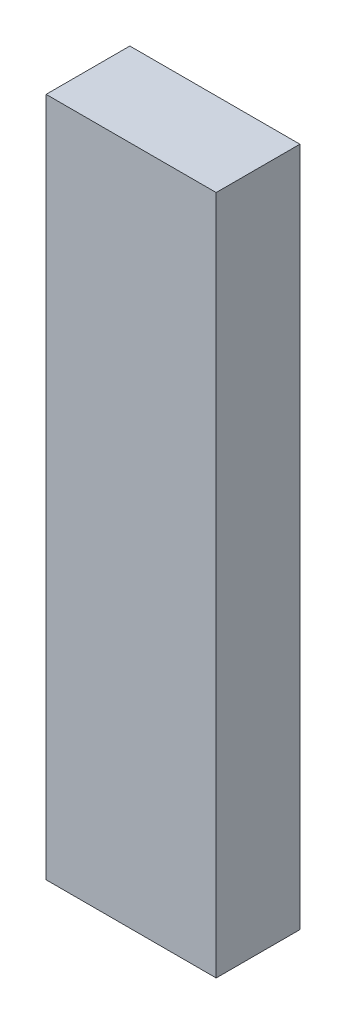
ISO-10303-21;
HEADER;
FILE_DESCRIPTION(('STEP AP214'),'2;1');
FILE_NAME('part.step','',(''),(''),'','','');
FILE_SCHEMA(('AUTOMOTIVE_DESIGN { 1 0 10303 214 1 1 1 1 }'));
ENDSEC;
DATA;
#1=APPLICATION_CONTEXT('core data for automotive mechanical design processes');
#2=APPLICATION_PROTOCOL_DEFINITION('international standard','automotive_design',2000,#1);
#3=PRODUCT_CONTEXT('',#1,'mechanical');
#4=PRODUCT('Part','Part','',(#3));
#5=PRODUCT_RELATED_PRODUCT_CATEGORY('part','',(#4));
#6=PRODUCT_DEFINITION_FORMATION('','',#4);
#7=PRODUCT_DEFINITION_CONTEXT('part definition',#1,'design');
#8=PRODUCT_DEFINITION('design','',#6,#7);
#9=PRODUCT_DEFINITION_SHAPE('','',#8);
#10=(LENGTH_UNIT() NAMED_UNIT(*) SI_UNIT(.MILLI.,.METRE.));
#11=(NAMED_UNIT(*) PLANE_ANGLE_UNIT() SI_UNIT($,.RADIAN.));
#12=(NAMED_UNIT(*) SI_UNIT($,.STERADIAN.) SOLID_ANGLE_UNIT());
#13=UNCERTAINTY_MEASURE_WITH_UNIT(LENGTH_MEASURE(1.E-05),#10,'distance_accuracy_value','');
#14=(GEOMETRIC_REPRESENTATION_CONTEXT(3) GLOBAL_UNCERTAINTY_ASSIGNED_CONTEXT((#13)) GLOBAL_UNIT_ASSIGNED_CONTEXT((#10,
#11,#12)) REPRESENTATION_CONTEXT('',''));
#15=CARTESIAN_POINT('',(0.,0.,0.));
#16=DIRECTION('',(0.,0.,1.));
#17=DIRECTION('',(1.,0.,0.));
#18=AXIS2_PLACEMENT_3D('',#15,#16,#17);
#19=CARTESIAN_POINT('',(-0.3250057,0.68579492,0.31999936));
#20=DIRECTION('',(0.,0.,-1.));
#21=DIRECTION('',(-1.,0.,0.));
#22=AXIS2_PLACEMENT_3D('',#19,#20,#21);
#23=PLANE('',#22);
#24=DIRECTION('',(1.,0.,0.));
#25=VECTOR('',#24,1.);
#26=CARTESIAN_POINT('',(-0.3250057,-1.91420496,0.31999936));
#27=LINE('',#26,#25);
#28=CARTESIAN_POINT('',(-0.3250057,-1.91420496,0.31999936));
#29=VERTEX_POINT('',#28);
#30=CARTESIAN_POINT('',(0.32499554,-1.91420496,0.31999936));
#31=VERTEX_POINT('',#30);
#32=EDGE_CURVE('E54',#29,#31,#27,.T.);
#33=ORIENTED_EDGE('',*,*,#32,.T.);
#34=DIRECTION('',(0.,1.,0.));
#35=VECTOR('',#34,1.);
#36=CARTESIAN_POINT('',(0.32499554,-1.91420496,0.31999936));
#37=LINE('',#36,#35);
#38=CARTESIAN_POINT('',(0.32499554,0.68579492,0.31999936));
#39=VERTEX_POINT('',#38);
#40=EDGE_CURVE('E56',#31,#39,#37,.T.);
#41=ORIENTED_EDGE('',*,*,#40,.T.);
#42=DIRECTION('',(1.,0.,0.));
#43=VECTOR('',#42,1.);
#44=CARTESIAN_POINT('',(0.32499554,0.68579492,0.31999936));
#45=LINE('',#44,#43);
#46=CARTESIAN_POINT('',(-0.3250057,0.68579492,0.31999936));
#47=VERTEX_POINT('',#46);
#48=EDGE_CURVE('E19',#39,#47,#45,.F.);
#49=ORIENTED_EDGE('',*,*,#48,.T.);
#50=DIRECTION('',(0.,1.,0.));
#51=VECTOR('',#50,1.);
#52=CARTESIAN_POINT('',(-0.3250057,0.68579492,0.31999936));
#53=LINE('',#52,#51);
#54=EDGE_CURVE('E79',#47,#29,#53,.F.);
#55=ORIENTED_EDGE('',*,*,#54,.T.);
#56=EDGE_LOOP('',(#33,#41,#49,#55));
#57=FACE_BOUND('',#56,.T.);
#58=ADVANCED_FACE('F16',(#57),#23,.F.);
#59=CARTESIAN_POINT('',(0.32499554,0.68579492,0.));
#60=DIRECTION('',(0.,-1.,0.));
#61=DIRECTION('',(0.,0.,-1.));
#62=AXIS2_PLACEMENT_3D('',#59,#60,#61);
#63=PLANE('',#62);
#64=DIRECTION('',(0.,0.,-1.));
#65=VECTOR('',#64,1.);
#66=CARTESIAN_POINT('',(-0.3250057,0.68579492,0.));
#67=LINE('',#66,#65);
#68=CARTESIAN_POINT('',(-0.3250057,0.68579492,0.));
#69=VERTEX_POINT('',#68);
#70=EDGE_CURVE('E67',#69,#47,#67,.F.);
#71=ORIENTED_EDGE('',*,*,#70,.T.);
#72=ORIENTED_EDGE('',*,*,#48,.F.);
#73=DIRECTION('',(0.,0.,1.));
#74=VECTOR('',#73,1.);
#75=CARTESIAN_POINT('',(0.32499554,0.68579492,0.));
#76=LINE('',#75,#74);
#77=CARTESIAN_POINT('',(0.32499554,0.68579492,0.));
#78=VERTEX_POINT('',#77);
#79=EDGE_CURVE('E62',#39,#78,#76,.F.);
#80=ORIENTED_EDGE('',*,*,#79,.T.);
#81=DIRECTION('',(-1.,0.,0.));
#82=VECTOR('',#81,1.);
#83=CARTESIAN_POINT('',(-0.3250057,0.68579492,0.));
#84=LINE('',#83,#82);
#85=EDGE_CURVE('E82',#69,#78,#84,.F.);
#86=ORIENTED_EDGE('',*,*,#85,.F.);
#87=EDGE_LOOP('',(#71,#72,#80,#86));
#88=FACE_BOUND('',#87,.T.);
#89=ADVANCED_FACE('F64',(#88),#63,.F.);
#90=CARTESIAN_POINT('',(0.32499554,-1.91420496,0.));
#91=DIRECTION('',(-1.,0.,0.));
#92=DIRECTION('',(0.,0.,1.));
#93=AXIS2_PLACEMENT_3D('',#90,#91,#92);
#94=PLANE('',#93);
#95=ORIENTED_EDGE('',*,*,#79,.F.);
#96=ORIENTED_EDGE('',*,*,#40,.F.);
#97=DIRECTION('',(0.,0.,1.));
#98=VECTOR('',#97,1.);
#99=CARTESIAN_POINT('',(0.32499554,-1.91420496,0.));
#100=LINE('',#99,#98);
#101=CARTESIAN_POINT('',(0.32499554,-1.91420496,0.));
#102=VERTEX_POINT('',#101);
#103=EDGE_CURVE('E74',#31,#102,#100,.F.);
#104=ORIENTED_EDGE('',*,*,#103,.T.);
#105=DIRECTION('',(0.,1.,0.));
#106=VECTOR('',#105,1.);
#107=CARTESIAN_POINT('',(0.32499554,0.68579492,0.));
#108=LINE('',#107,#106);
#109=EDGE_CURVE('E71',#78,#102,#108,.F.);
#110=ORIENTED_EDGE('',*,*,#109,.F.);
#111=EDGE_LOOP('',(#95,#96,#104,#110));
#112=FACE_BOUND('',#111,.T.);
#113=ADVANCED_FACE('F69',(#112),#94,.F.);
#114=CARTESIAN_POINT('',(-0.3250057,-1.91420496,0.));
#115=DIRECTION('',(0.,1.,0.));
#116=DIRECTION('',(0.,0.,1.));
#117=AXIS2_PLACEMENT_3D('',#114,#115,#116);
#118=PLANE('',#117);
#119=ORIENTED_EDGE('',*,*,#103,.F.);
#120=ORIENTED_EDGE('',*,*,#32,.F.);
#121=DIRECTION('',(0.,0.,-1.));
#122=VECTOR('',#121,1.);
#123=CARTESIAN_POINT('',(-0.3250057,-1.91420496,0.));
#124=LINE('',#123,#122);
#125=CARTESIAN_POINT('',(-0.3250057,-1.91420496,0.));
#126=VERTEX_POINT('',#125);
#127=EDGE_CURVE('E34',#29,#126,#124,.T.);
#128=ORIENTED_EDGE('',*,*,#127,.T.);
#129=DIRECTION('',(-1.,0.,0.));
#130=VECTOR('',#129,1.);
#131=CARTESIAN_POINT('',(-0.3250057,-1.91420496,0.));
#132=LINE('',#131,#130);
#133=EDGE_CURVE('E25',#102,#126,#132,.T.);
#134=ORIENTED_EDGE('',*,*,#133,.F.);
#135=EDGE_LOOP('',(#119,#120,#128,#134));
#136=FACE_BOUND('',#135,.T.);
#137=ADVANCED_FACE('F88',(#136),#118,.F.);
#138=CARTESIAN_POINT('',(-0.3250057,0.68579492,0.));
#139=DIRECTION('',(1.,0.,0.));
#140=DIRECTION('',(0.,0.,-1.));
#141=AXIS2_PLACEMENT_3D('',#138,#139,#140);
#142=PLANE('',#141);
#143=ORIENTED_EDGE('',*,*,#127,.F.);
#144=ORIENTED_EDGE('',*,*,#54,.F.);
#145=ORIENTED_EDGE('',*,*,#70,.F.);
#146=DIRECTION('',(0.,1.,0.));
#147=VECTOR('',#146,1.);
#148=CARTESIAN_POINT('',(-0.3250057,0.68579492,0.));
#149=LINE('',#148,#147);
#150=EDGE_CURVE('E11',#126,#69,#149,.T.);
#151=ORIENTED_EDGE('',*,*,#150,.F.);
#152=EDGE_LOOP('',(#143,#144,#145,#151));
#153=FACE_BOUND('',#152,.T.);
#154=ADVANCED_FACE('F90',(#153),#142,.F.);
#155=CARTESIAN_POINT('',(-0.3250057,0.68579492,0.));
#156=DIRECTION('',(0.,0.,-1.));
#157=DIRECTION('',(-1.,0.,0.));
#158=AXIS2_PLACEMENT_3D('',#155,#156,#157);
#159=PLANE('',#158);
#160=ORIENTED_EDGE('',*,*,#133,.T.);
#161=ORIENTED_EDGE('',*,*,#150,.T.);
#162=ORIENTED_EDGE('',*,*,#85,.T.);
#163=ORIENTED_EDGE('',*,*,#109,.T.);
#164=EDGE_LOOP('',(#160,#161,#162,#163));
#165=FACE_BOUND('',#164,.T.);
#166=ADVANCED_FACE('F87',(#165),#159,.T.);
#167=CLOSED_SHELL('',(#58,#89,#113,#137,#154,#166));
#168=MANIFOLD_SOLID_BREP('B1',#167);
#169=ADVANCED_BREP_SHAPE_REPRESENTATION('',(#18,#168),#14);
#170=SHAPE_DEFINITION_REPRESENTATION(#9,#169);
ENDSEC;
END-ISO-10303-21;
